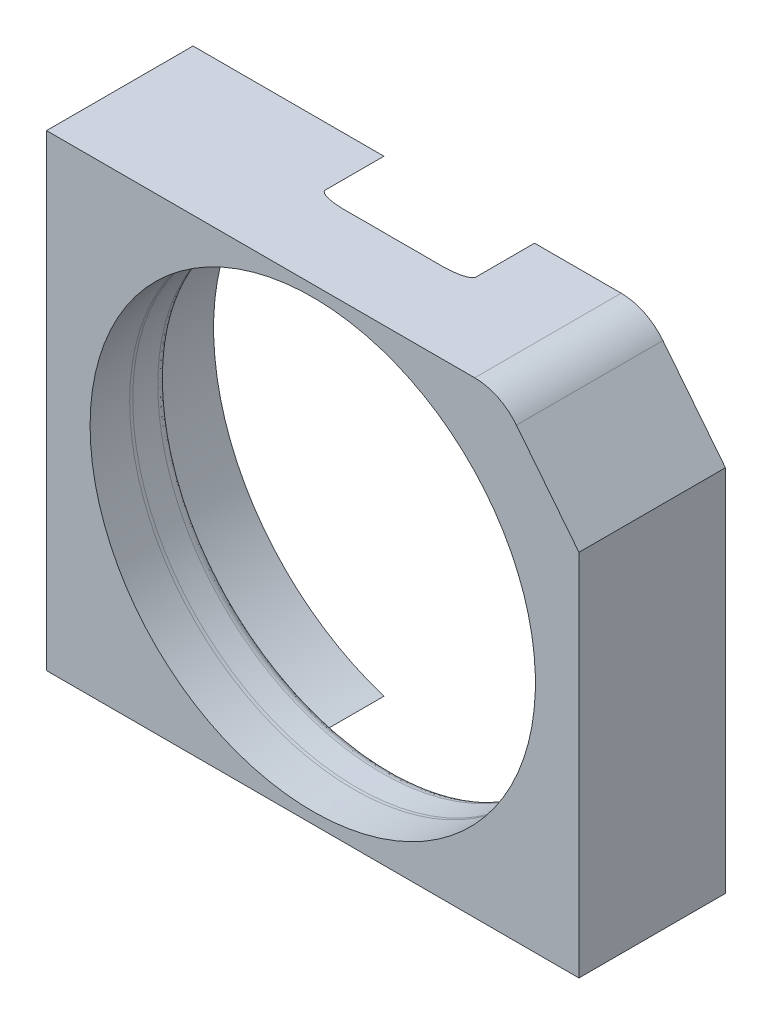
ISO-10303-21;
HEADER;
FILE_DESCRIPTION(('STEP AP214'),'2;1');
FILE_NAME('part.step','',(''),(''),'','','');
FILE_SCHEMA(('AUTOMOTIVE_DESIGN { 1 0 10303 214 1 1 1 1 }'));
ENDSEC;
DATA;
#1=APPLICATION_CONTEXT('core data for automotive mechanical design processes');
#2=APPLICATION_PROTOCOL_DEFINITION('international standard','automotive_design',2000,#1);
#3=PRODUCT_CONTEXT('',#1,'mechanical');
#4=PRODUCT('Part','Part','',(#3));
#5=PRODUCT_RELATED_PRODUCT_CATEGORY('part','',(#4));
#6=PRODUCT_DEFINITION_FORMATION('','',#4);
#7=PRODUCT_DEFINITION_CONTEXT('part definition',#1,'design');
#8=PRODUCT_DEFINITION('design','',#6,#7);
#9=PRODUCT_DEFINITION_SHAPE('','',#8);
#10=(LENGTH_UNIT() NAMED_UNIT(*) SI_UNIT(.MILLI.,.METRE.));
#11=(NAMED_UNIT(*) PLANE_ANGLE_UNIT() SI_UNIT($,.RADIAN.));
#12=(NAMED_UNIT(*) SI_UNIT($,.STERADIAN.) SOLID_ANGLE_UNIT());
#13=UNCERTAINTY_MEASURE_WITH_UNIT(LENGTH_MEASURE(1.E-05),#10,'distance_accuracy_value','');
#14=(GEOMETRIC_REPRESENTATION_CONTEXT(3) GLOBAL_UNCERTAINTY_ASSIGNED_CONTEXT((#13)) GLOBAL_UNIT_ASSIGNED_CONTEXT((#10,
#11,#12)) REPRESENTATION_CONTEXT('',''));
#15=CARTESIAN_POINT('',(0.,0.,0.));
#16=DIRECTION('',(0.,0.,1.));
#17=DIRECTION('',(1.,0.,0.));
#18=AXIS2_PLACEMENT_3D('',#15,#16,#17);
#19=CARTESIAN_POINT('',(241.253264434507,233.525,0.));
#20=DIRECTION('',(0.,0.,-1.));
#21=DIRECTION('',(-1.,0.,0.));
#22=AXIS2_PLACEMENT_3D('',#19,#20,#21);
#23=PLANE('',#22);
#24=CARTESIAN_POINT('',(149.999999999996,131.762500000001,0.));
#25=DIRECTION('',(0.,0.,-1.));
#26=DIRECTION('',(-1.,0.,0.));
#27=AXIS2_PLACEMENT_3D('',#24,#25,#26);
#28=CIRCLE('',#27,138.427487940003);
#29=CARTESIAN_POINT('',(192.435987217568,263.525,0.));
#30=VERTEX_POINT('',#29);
#31=CARTESIAN_POINT('',(192.435987217565,0.,0.));
#32=VERTEX_POINT('',#31);
#33=EDGE_CURVE('E130',#30,#32,#28,.T.);
#34=ORIENTED_EDGE('',*,*,#33,.F.);
#35=DIRECTION('',(-1.,0.,0.));
#36=VECTOR('',#35,1.);
#37=CARTESIAN_POINT('',(71.6,263.525,0.));
#38=LINE('',#37,#36);
#39=CARTESIAN_POINT('',(241.253264434507,263.525,0.));
#40=VERTEX_POINT('',#39);
#41=EDGE_CURVE('E142',#40,#30,#38,.T.);
#42=ORIENTED_EDGE('',*,*,#41,.F.);
#43=CARTESIAN_POINT('',(241.253264434507,233.525,0.));
#44=DIRECTION('',(0.,0.,1.));
#45=DIRECTION('',(-1.,0.,0.));
#46=AXIS2_PLACEMENT_3D('',#43,#44,#45);
#47=CIRCLE('',#46,30.);
#48=CARTESIAN_POINT('',(264.758194807193,252.166841330061,0.));
#49=VERTEX_POINT('',#48);
#50=EDGE_CURVE('E151',#49,#40,#47,.T.);
#51=ORIENTED_EDGE('',*,*,#50,.F.);
#52=DIRECTION('',(-0.621394711002044,0.783497679089534,0.));
#53=VECTOR('',#52,1.);
#54=CARTESIAN_POINT('',(264.758194807193,252.166841330061,0.));
#55=LINE('',#54,#53);
#56=CARTESIAN_POINT('',(300.,207.73152173913,0.));
#57=VERTEX_POINT('',#56);
#58=EDGE_CURVE('E262',#57,#49,#55,.T.);
#59=ORIENTED_EDGE('',*,*,#58,.F.);
#60=DIRECTION('',(0.,1.,0.));
#61=VECTOR('',#60,1.);
#62=CARTESIAN_POINT('',(300.,0.,0.));
#63=LINE('',#62,#61);
#64=CARTESIAN_POINT('',(300.,0.,0.));
#65=VERTEX_POINT('',#64);
#66=EDGE_CURVE('E265',#65,#57,#63,.T.);
#67=ORIENTED_EDGE('',*,*,#66,.F.);
#68=DIRECTION('',(1.,0.,0.));
#69=VECTOR('',#68,1.);
#70=CARTESIAN_POINT('',(0.,0.,0.));
#71=LINE('',#70,#69);
#72=EDGE_CURVE('E145',#32,#65,#71,.T.);
#73=ORIENTED_EDGE('',*,*,#72,.F.);
#74=EDGE_LOOP('',(#34,#42,#51,#59,#67,#73));
#75=FACE_BOUND('',#74,.T.);
#76=ADVANCED_FACE('F35',(#75),#23,.T.);
#77=CARTESIAN_POINT('',(149.999999999999,131.7625,200.400182821007));
#78=DIRECTION('',(0.,0.,1.));
#79=DIRECTION('',(1.,0.,0.));
#80=AXIS2_PLACEMENT_3D('',#77,#78,#79);
#81=CYLINDRICAL_SURFACE('',#80,138.427487940002);
#82=DIRECTION('',(0.,0.,1.));
#83=VECTOR('',#82,1.);
#84=CARTESIAN_POINT('',(192.435987217563,0.,200.400182821006));
#85=LINE('',#84,#83);
#86=CARTESIAN_POINT('',(192.435987217559,0.,33.0000000025175));
#87=VERTEX_POINT('',#86);
#88=EDGE_CURVE('E137',#87,#32,#85,.F.);
#89=ORIENTED_EDGE('',*,*,#88,.F.);
#90=CARTESIAN_POINT('',(149.999999999996,131.762500000001,33.0000000025187));
#91=DIRECTION('',(0.,0.,1.));
#92=DIRECTION('',(1.,0.,0.));
#93=AXIS2_PLACEMENT_3D('',#90,#91,#92);
#94=CIRCLE('',#93,138.427487940002);
#95=CARTESIAN_POINT('',(192.435987217562,263.525000000001,33.0000000025184));
#96=VERTEX_POINT('',#95);
#97=EDGE_CURVE('E133',#87,#96,#94,.T.);
#98=ORIENTED_EDGE('',*,*,#97,.T.);
#99=DIRECTION('',(0.,0.,1.));
#100=VECTOR('',#99,1.);
#101=CARTESIAN_POINT('',(192.435987217565,263.525,200.400182821006));
#102=LINE('',#101,#100);
#103=EDGE_CURVE('E126',#30,#96,#102,.T.);
#104=ORIENTED_EDGE('',*,*,#103,.F.);
#105=ORIENTED_EDGE('',*,*,#33,.T.);
#106=EDGE_LOOP('',(#89,#98,#104,#105));
#107=FACE_BOUND('',#106,.T.);
#108=ADVANCED_FACE('F129',(#107),#81,.F.);
#109=DIRECTION('',(0.,0.,1.));
#110=VECTOR('',#109,1.);
#111=CARTESIAN_POINT('',(107.564012782434,0.,200.400182821008));
#112=LINE('',#111,#110);
#113=CARTESIAN_POINT('',(107.564012782428,0.,0.));
#114=VERTEX_POINT('',#113);
#115=CARTESIAN_POINT('',(107.564012782433,0.,33.000000002519));
#116=VERTEX_POINT('',#115);
#117=EDGE_CURVE('E327',#114,#116,#112,.T.);
#118=ORIENTED_EDGE('',*,*,#117,.F.);
#119=CARTESIAN_POINT('',(107.564012782425,263.525,0.));
#120=VERTEX_POINT('',#119);
#121=EDGE_CURVE('E146',#114,#120,#28,.T.);
#122=ORIENTED_EDGE('',*,*,#121,.T.);
#123=DIRECTION('',(0.,0.,1.));
#124=VECTOR('',#123,1.);
#125=CARTESIAN_POINT('',(107.564012782432,263.525,200.400182821008));
#126=LINE('',#125,#124);
#127=CARTESIAN_POINT('',(107.564012782429,263.525000000001,33.0000000025199));
#128=VERTEX_POINT('',#127);
#129=EDGE_CURVE('E51',#128,#120,#126,.F.);
#130=ORIENTED_EDGE('',*,*,#129,.F.);
#131=EDGE_CURVE('E164',#128,#116,#94,.T.);
#132=ORIENTED_EDGE('',*,*,#131,.T.);
#133=EDGE_LOOP('',(#118,#122,#130,#132));
#134=FACE_BOUND('',#133,.T.);
#135=ADVANCED_FACE('F210',(#134),#81,.F.);
#136=CARTESIAN_POINT('',(283.519735499998,131.762500000001,37.2754741948837));
#137=CARTESIAN_POINT('',(286.705561076155,131.762500000001,37.7272814708559));
#138=CARTESIAN_POINT('',(288.427487939998,131.762500000001,35.3951219955774));
#139=CARTESIAN_POINT('',(288.427487939998,131.762500000001,33.0000000025163));
#140=(BOUNDED_CURVE() B_SPLINE_CURVE(3,(#136,#137,#138,#139),.UNSPECIFIED.,.F.,
.F.) B_SPLINE_CURVE_WITH_KNOTS((4,4),(0.,1.),
.UNSPECIFIED.) CURVE() GEOMETRIC_REPRESENTATION_ITEM() RATIONAL_B_SPLINE_CURVE((0.255591691964592,
0.242825015050017,0.327183181081988,0.508666190060503)) REPRESENTATION_ITEM(''));
#141=CARTESIAN_POINT('',(149.999999999999,131.7625,200.400182821007));
#142=DIRECTION('',(0.,0.,1.));
#143=AXIS1_PLACEMENT('',#141,#142);
#144=SURFACE_OF_REVOLUTION('',#140,#143);
#145=CARTESIAN_POINT('',(107.564012782433,0.,33.000000002519));
#146=CARTESIAN_POINT('',(107.563988911195,0.,33.0434393153711));
#147=CARTESIAN_POINT('',(107.566143823895,0.,33.0868642980806));
#148=CARTESIAN_POINT('',(107.574624732559,0.,33.173242419756));
#149=CARTESIAN_POINT('',(107.580944551883,0.,33.2161961618271));
#150=CARTESIAN_POINT('',(107.597454816036,0.,33.3007307171298));
#151=CARTESIAN_POINT('',(107.607590514751,0.,33.3423223025527));
#152=CARTESIAN_POINT('',(107.631432707945,0.,33.4244716410913));
#153=CARTESIAN_POINT('',(107.645140643406,0.,33.4650289697398));
#154=CARTESIAN_POINT('',(107.698488523508,0.,33.6040140451596));
#155=CARTESIAN_POINT('',(107.746492052493,0.,33.6992960167719));
#156=CARTESIAN_POINT('',(107.857158583655,0.,33.88129015289));
#157=CARTESIAN_POINT('',(107.919906580302,0.,33.9679483186602));
#158=CARTESIAN_POINT('',(108.045715756808,0.,34.1207884449625));
#159=CARTESIAN_POINT('',(108.107411166014,0.,34.1881171948753));
#160=CARTESIAN_POINT('',(108.236385638506,0.,34.3172409887719));
#161=CARTESIAN_POINT('',(108.303669016466,0.,34.3790316786259));
#162=CARTESIAN_POINT('',(108.442492707312,0.,34.4977629716425));
#163=CARTESIAN_POINT('',(108.514038147027,0.,34.5546975247705));
#164=CARTESIAN_POINT('',(108.660323636422,0.,34.6642181857244));
#165=CARTESIAN_POINT('',(108.735062733715,0.,34.7168055763861));
#166=CARTESIAN_POINT('',(108.955482946942,-1.52885071211244E-13,34.8638515831892));
#167=CARTESIAN_POINT('',(109.104453084509,0.,34.9533818094659));
#168=CARTESIAN_POINT('',(109.408534350831,0.,35.121723090095));
#169=CARTESIAN_POINT('',(109.563655579712,0.,35.200515485043));
#170=CARTESIAN_POINT('',(109.878182482482,0.,35.3493041042935));
#171=CARTESIAN_POINT('',(110.037591504249,0.,35.4192931978976));
#172=CARTESIAN_POINT('',(110.360294362463,0.,35.5522455571296));
#173=CARTESIAN_POINT('',(110.523604553766,0.,35.615168751578));
#174=CARTESIAN_POINT('',(110.852332671143,0.,35.7346221830564));
#175=CARTESIAN_POINT('',(111.017748131695,0.,35.7911592477389));
#176=CARTESIAN_POINT('',(111.350268835672,0.,35.89876559062));
#177=CARTESIAN_POINT('',(111.517373428286,0.,35.9498368929839));
#178=CARTESIAN_POINT('',(111.909421724469,0.,36.0636119881737));
#179=CARTESIAN_POINT('',(112.134906907448,0.,36.1244472986272));
#180=CARTESIAN_POINT('',(112.587713832595,0.,36.2389021600031));
#181=CARTESIAN_POINT('',(112.815035804109,0.,36.2925207946015));
#182=CARTESIAN_POINT('',(113.271362522591,0.,36.3935729941314));
#183=CARTESIAN_POINT('',(113.500369112764,0.,36.4409981956174));
#184=CARTESIAN_POINT('',(113.95945745267,0.,36.5303478237248));
#185=CARTESIAN_POINT('',(114.189539261048,0.,36.572271946598));
#186=CARTESIAN_POINT('',(114.881710117119,0.,36.6908713714809));
#187=CARTESIAN_POINT('',(115.345058939133,0.,36.7602305510334));
#188=CARTESIAN_POINT('',(116.273882629915,0.,36.8832723715307));
#189=CARTESIAN_POINT('',(116.739357962509,0.,36.9369514085703));
#190=CARTESIAN_POINT('',(117.672366678869,0.,37.0313983651965));
#191=CARTESIAN_POINT('',(118.139902180108,0.,37.0721451074191));
#192=CARTESIAN_POINT('',(119.07522300323,0.,37.1426513582287));
#193=CARTESIAN_POINT('',(119.543007359201,0.,37.172423936171));
#194=CARTESIAN_POINT('',(120.478822552575,0.,37.2226797348076));
#195=CARTESIAN_POINT('',(120.946853137393,0.,37.2431677516684));
#196=CARTESIAN_POINT('',(121.883171291607,0.,37.2762229129907));
#197=CARTESIAN_POINT('',(122.351458851319,1.00978485318525E-13,37.288790337833));
#198=CARTESIAN_POINT('',(123.131279353968,0.,37.3040646799129));
#199=CARTESIAN_POINT('',(123.442777675769,0.,37.3086644314646));
#200=CARTESIAN_POINT('',(124.065855234345,0.,37.3151557165911));
#201=CARTESIAN_POINT('',(124.377434475892,0.,37.3170467915974));
#202=CARTESIAN_POINT('',(125.000627699693,0.,37.3183916086862));
#203=CARTESIAN_POINT('',(125.312241682374,0.,37.3178451131127));
#204=CARTESIAN_POINT('',(125.933408276533,0.,37.3145762343991));
#205=CARTESIAN_POINT('',(126.242960966596,0.,37.3118681852725));
#206=CARTESIAN_POINT('',(126.862011405921,0.,37.3045255586764));
#207=CARTESIAN_POINT('',(127.171509157569,0.,37.2998911770293));
#208=CARTESIAN_POINT('',(127.790405207438,0.,37.2889117740155));
#209=CARTESIAN_POINT('',(128.099803512413,0.,37.2825671358307));
#210=CARTESIAN_POINT('',(128.409183393385,0.,37.2754741948859));
#211=B_SPLINE_CURVE_WITH_KNOTS('',3,(#145,#146,#147,#148,#149,#150,#151,#152,#153,#154,#155,
#156,#157,#158,#159,#160,#161,#162,#163,#164,#165,#166,#167,#168,#169,#170,#171,#172,#173,#174,
#175,#176,#177,#178,#179,#180,#181,#182,#183,#184,#185,#186,#187,#188,#189,#190,#191,#192,#193,
#194,#195,#196,#197,#198,#199,#200,#201,#202,#203,#204,#205,#206,#207,#208,#209,#210),
.UNSPECIFIED.,.F.,.F.,(4,2,2,2,2,2,2,2,2,2,2,2,2,2,2,2,2,2,2,2,2,2,2,2,2,2,2,2,2,2,2,2,4),(0.,
0.130241429364125,0.260290141443634,0.388540068376498,0.516841809550053,0.834941817756587,
1.15492255672217,1.42848738000261,1.70226543229411,1.97637973595558,2.25041285831291,
2.77116249269915,3.29280581231076,3.81486898006019,4.33975738168677,4.86407918468302,
5.38820613589148,6.08869943050479,6.7892815852258,7.4908002146516,8.19235756293695,
9.59751309808097,11.002991338828,12.4107593945459,13.816845452039,15.2222043311808,
16.6275134592734,17.5620991178273,18.4968429794866,19.4316779779737,20.3603647546451,
21.288957148295,22.2173416641329),.UNSPECIFIED.);
#212=CARTESIAN_POINT('',(128.409183393386,0.,37.275474194886));
#213=VERTEX_POINT('',#212);
#214=EDGE_CURVE('E59',#116,#213,#211,.T.);
#215=ORIENTED_EDGE('',*,*,#214,.F.);
#216=ORIENTED_EDGE('',*,*,#131,.F.);
#217=CARTESIAN_POINT('',(128.409183393374,263.525,37.2754741948868));
#218=CARTESIAN_POINT('',(128.051894710239,263.525,37.2836641761605));
#219=CARTESIAN_POINT('',(127.6945808691,263.525,37.2908580436216));
#220=CARTESIAN_POINT('',(126.979800252876,263.525,37.3029213767301));
#221=CARTESIAN_POINT('',(126.622333465375,263.525,37.3077900998672));
#222=CARTESIAN_POINT('',(125.907308636066,263.525,37.3148659469851));
#223=CARTESIAN_POINT('',(125.549750589352,263.525,37.3170725961095));
#224=CARTESIAN_POINT('',(124.834606252839,263.525,37.3184574758383));
#225=CARTESIAN_POINT('',(124.477019962629,263.525,37.3176355252875));
#226=CARTESIAN_POINT('',(123.760859504184,263.525,37.3125603889058));
#227=CARTESIAN_POINT('',(123.402285400806,263.525,37.3082975102587));
#228=CARTESIAN_POINT('',(122.685229894357,263.525,37.2958901570463));
#229=CARTESIAN_POINT('',(122.326748486316,263.525,37.2877459769455));
#230=CARTESIAN_POINT('',(121.60994018102,263.525,37.2670886446054));
#231=CARTESIAN_POINT('',(121.251613273173,263.525,37.2545758660324));
#232=CARTESIAN_POINT('',(120.53517713601,263.525,37.2246302296394));
#233=CARTESIAN_POINT('',(120.177067898286,263.525,37.2071975758378));
#234=CARTESIAN_POINT('',(119.472458511016,263.525,37.1674163274857));
#235=CARTESIAN_POINT('',(119.125948714547,263.525,37.1452402692858));
#236=CARTESIAN_POINT('',(118.433337233113,263.525,37.0950078689188));
#237=CARTESIAN_POINT('',(118.087235565238,263.525,37.0669512887018));
#238=CARTESIAN_POINT('',(117.39558596318,263.525,37.0041603520604));
#239=CARTESIAN_POINT('',(117.050038109821,263.525,36.9694250971018));
#240=CARTESIAN_POINT('',(116.359590004402,263.525,36.8922968555982));
#241=CARTESIAN_POINT('',(116.014690234281,263.525,36.8498995114988));
#242=CARTESIAN_POINT('',(115.326116320868,263.525,36.7562713772811));
#243=CARTESIAN_POINT('',(114.982442058973,263.525,36.7050414670269));
#244=CARTESIAN_POINT('',(114.296852999469,263.525,36.5922400283021));
#245=CARTESIAN_POINT('',(113.954937812492,263.525,36.5306708997104));
#246=CARTESIAN_POINT('',(113.342578387325,263.525,36.4088892849372));
#247=CARTESIAN_POINT('',(113.071688159953,263.525,36.350928985456));
#248=CARTESIAN_POINT('',(112.531986217608,263.525,36.2257654929522));
#249=CARTESIAN_POINT('',(112.263174825383,263.525,36.1585608939787));
#250=CARTESIAN_POINT('',(111.729479500192,263.525,36.0133604224585));
#251=CARTESIAN_POINT('',(111.464584999961,263.525,35.9354037755901));
#252=CARTESIAN_POINT('',(110.939177098807,263.525,35.7660655485733));
#253=CARTESIAN_POINT('',(110.678661894095,263.525,35.6746896545641));
#254=CARTESIAN_POINT('',(110.223056142982,263.525,35.4977009565297));
#255=CARTESIAN_POINT('',(110.026636970608,263.525,35.4155548510646));
#256=CARTESIAN_POINT('',(109.735818493693,263.525,35.2826000075541));
#257=CARTESIAN_POINT('',(109.639255498186,263.525,35.2365197732933));
#258=CARTESIAN_POINT('',(109.447949554132,263.525,35.1407358617284));
#259=CARTESIAN_POINT('',(109.35320641394,263.525,35.091032568634));
#260=CARTESIAN_POINT('',(109.138333573493,263.525,34.9722147119986));
#261=CARTESIAN_POINT('',(109.018968390922,263.525,34.9017020260968));
#262=CARTESIAN_POINT('',(108.785349757699,263.525,34.7522949595584));
#263=CARTESIAN_POINT('',(108.671101925771,263.525,34.6733916720582));
#264=CARTESIAN_POINT('',(108.450989762533,263.525,34.506097782546));
#265=CARTESIAN_POINT('',(108.345070978818,263.525,34.4177796013186));
#266=CARTESIAN_POINT('',(108.144622993734,263.525,34.2291331654217));
#267=CARTESIAN_POINT('',(108.050062419983,263.525,34.1288395928631));
#268=CARTESIAN_POINT('',(107.935041881477,263.525,33.9848109789745));
#269=CARTESIAN_POINT('',(107.906759946686,263.525,33.9472762981489));
#270=CARTESIAN_POINT('',(107.852620597751,263.525,33.8704851403311));
#271=CARTESIAN_POINT('',(107.826763127543,263.525,33.8312287031852));
#272=CARTESIAN_POINT('',(107.777981826993,263.525,33.7511543108066));
#273=CARTESIAN_POINT('',(107.755045988739,263.525,33.7103437059798));
#274=CARTESIAN_POINT('',(107.712426164581,263.525,33.6270452176555));
#275=CARTESIAN_POINT('',(107.692742285601,263.525,33.584557279064));
#276=CARTESIAN_POINT('',(107.657416466249,263.525,33.4987945123038));
#277=CARTESIAN_POINT('',(107.641709629132,263.525,33.4555465963542));
#278=CARTESIAN_POINT('',(107.61433987614,263.525,33.367798178957));
#279=CARTESIAN_POINT('',(107.602675383712,263.525,33.3232981731746));
#280=CARTESIAN_POINT('',(107.583625199713,263.525,33.2326422484606));
#281=CARTESIAN_POINT('',(107.576310440143,263.525,33.1864712531426));
#282=CARTESIAN_POINT('',(107.566483790554,263.525,33.093540588437));
#283=CARTESIAN_POINT('',(107.563980524835,263.525,33.0467800129328));
#284=CARTESIAN_POINT('',(107.564012782427,263.525,33.0000000025199));
#285=B_SPLINE_CURVE_WITH_KNOTS('',3,(#217,#218,#219,#220,#221,#222,#223,#224,#225,#226,#227,
#228,#229,#230,#231,#232,#233,#234,#235,#236,#237,#238,#239,#240,#241,#242,#243,#244,#245,#246,
#247,#248,#249,#250,#251,#252,#253,#254,#255,#256,#257,#258,#259,#260,#261,#262,#263,#264,#265,
#266,#267,#268,#269,#270,#271,#272,#273,#274,#275,#276,#277,#278,#279,#280,#281,#282,#283,#284),
.UNSPECIFIED.,.F.,.F.,(4,2,2,2,2,2,2,2,2,2,2,2,2,2,2,2,2,2,2,2,2,2,2,2,2,2,2,2,2,2,2,2,2,4),(0.,
1.07214969800926,2.14464154708534,3.21732467720169,4.29007197070426,5.36585169632604,
6.44154981826362,7.51715595332175,8.59271749148728,9.63432970381734,10.6759840898922,
11.7177787160515,12.7601677029906,13.802452911334,14.8444965240809,15.6754296450747,
16.5064892813857,17.3345935148826,18.1623478627303,18.8006703086957,19.1215899108674,
19.4424755302602,19.8581120492394,20.2741942678702,20.6872798417487,21.0991968367766,
21.2401141352356,21.3810281741905,21.5213429653124,21.6616623690712,21.799518187145,
21.9373201794314,22.0773117464936,22.2175540064837),.UNSPECIFIED.);
#286=CARTESIAN_POINT('',(128.409183393374,263.525,37.2754741948869));
#287=VERTEX_POINT('',#286);
#288=EDGE_CURVE('E199',#287,#128,#285,.T.);
#289=ORIENTED_EDGE('',*,*,#288,.F.);
#290=CARTESIAN_POINT('',(149.999999999996,131.762500000001,37.2754741948861));
#291=DIRECTION('',(0.,0.,1.));
#292=DIRECTION('',(1.,0.,0.));
#293=AXIS2_PLACEMENT_3D('',#290,#291,#292);
#294=CIRCLE('',#293,133.519735500002);
#295=EDGE_CURVE('E331',#287,#213,#294,.T.);
#296=ORIENTED_EDGE('',*,*,#295,.T.);
#297=EDGE_LOOP('',(#215,#216,#289,#296));
#298=FACE_BOUND('',#297,.T.);
#299=ADVANCED_FACE('F205',(#298),#144,.T.);
#300=CARTESIAN_POINT('',(171.590816606606,0.,37.2754741948852));
#301=CARTESIAN_POINT('',(171.948105289742,0.,37.2836641761588));
#302=CARTESIAN_POINT('',(172.305419130881,0.,37.2908580436199));
#303=CARTESIAN_POINT('',(173.020199747104,0.,37.3029213767283));
#304=CARTESIAN_POINT('',(173.377666534605,0.,37.3077900998654));
#305=CARTESIAN_POINT('',(174.092691363915,0.,37.3148659469833));
#306=CARTESIAN_POINT('',(174.450249410628,0.,37.3170725961077));
#307=CARTESIAN_POINT('',(175.165393747142,0.,37.3184574758365));
#308=CARTESIAN_POINT('',(175.522980037352,0.,37.3176355252857));
#309=CARTESIAN_POINT('',(176.239140495796,0.,37.3125603889039));
#310=CARTESIAN_POINT('',(176.597714599174,0.,37.3082975102568));
#311=CARTESIAN_POINT('',(177.314770105624,0.,37.2958901570445));
#312=CARTESIAN_POINT('',(177.673251513664,0.,37.2877459769437));
#313=CARTESIAN_POINT('',(178.39005981896,0.,37.2670886446036));
#314=CARTESIAN_POINT('',(178.748386726808,0.,37.2545758660306));
#315=CARTESIAN_POINT('',(179.46482286397,0.,37.2246302296376));
#316=CARTESIAN_POINT('',(179.822932101695,0.,37.207197575836));
#317=CARTESIAN_POINT('',(180.527541488965,0.,37.1674163274839));
#318=CARTESIAN_POINT('',(180.874051285433,0.,37.145240269284));
#319=CARTESIAN_POINT('',(181.566662766868,0.,37.095007868917));
#320=CARTESIAN_POINT('',(181.912764434743,0.,37.0669512887));
#321=CARTESIAN_POINT('',(182.604414036801,0.,37.0041603520587));
#322=CARTESIAN_POINT('',(182.94996189016,0.,36.9694250971001));
#323=CARTESIAN_POINT('',(183.64040999558,0.,36.8922968555965));
#324=CARTESIAN_POINT('',(183.985309765701,0.,36.849899511497));
#325=CARTESIAN_POINT('',(184.673883679114,0.,36.7562713772792));
#326=CARTESIAN_POINT('',(185.017557941009,0.,36.7050414670251));
#327=CARTESIAN_POINT('',(185.703147000513,0.,36.5922400283003));
#328=CARTESIAN_POINT('',(186.04506218749,0.,36.5306708997086));
#329=CARTESIAN_POINT('',(186.657421612658,0.,36.4088892849355));
#330=CARTESIAN_POINT('',(186.92831184003,0.,36.3509289854544));
#331=CARTESIAN_POINT('',(187.468013782375,0.,36.2257654929505));
#332=CARTESIAN_POINT('',(187.7368251746,0.,36.1585608939769));
#333=CARTESIAN_POINT('',(188.270520499792,0.,36.0133604224565));
#334=CARTESIAN_POINT('',(188.535415000023,0.,35.9354037755883));
#335=CARTESIAN_POINT('',(189.060822901178,0.,35.7660655485716));
#336=CARTESIAN_POINT('',(189.32133810589,0.,35.6746896545623));
#337=CARTESIAN_POINT('',(189.776943857002,0.,35.4977009565278));
#338=CARTESIAN_POINT('',(189.973363029377,0.,35.4155548510626));
#339=CARTESIAN_POINT('',(190.264181506291,0.,35.2826000075521));
#340=CARTESIAN_POINT('',(190.360744501799,0.,35.2365197732914));
#341=CARTESIAN_POINT('',(190.552050445853,0.,35.1407358617264));
#342=CARTESIAN_POINT('',(190.646793586045,0.,35.0910325686321));
#343=CARTESIAN_POINT('',(190.861666426492,0.,34.9722147119966));
#344=CARTESIAN_POINT('',(190.981031609064,0.,34.9017020260949));
#345=CARTESIAN_POINT('',(191.214650242286,0.,34.7522949595564));
#346=CARTESIAN_POINT('',(191.328898074214,0.,34.6733916720561));
#347=CARTESIAN_POINT('',(191.549010237452,0.,34.5060977825438));
#348=CARTESIAN_POINT('',(191.654929021168,0.,34.4177796013163));
#349=CARTESIAN_POINT('',(191.855377006251,0.,34.2291331654195));
#350=CARTESIAN_POINT('',(191.949937580003,0.,34.1288395928609));
#351=CARTESIAN_POINT('',(192.064958118508,0.,33.9848109789724));
#352=CARTESIAN_POINT('',(192.0932400533,0.,33.9472762981468));
#353=CARTESIAN_POINT('',(192.147379402234,0.,33.870485140329));
#354=CARTESIAN_POINT('',(192.173236872443,0.,33.8312287031831));
#355=CARTESIAN_POINT('',(192.222018172993,0.,33.7511543108045));
#356=CARTESIAN_POINT('',(192.244954011247,0.,33.7103437059777));
#357=CARTESIAN_POINT('',(192.287573835405,0.,33.6270452176534));
#358=CARTESIAN_POINT('',(192.307257714384,0.,33.5845572790619));
#359=CARTESIAN_POINT('',(192.342583533736,0.,33.4987945123017));
#360=CARTESIAN_POINT('',(192.358290370854,0.,33.455546596352));
#361=CARTESIAN_POINT('',(192.385660123846,0.,33.3677981789548));
#362=CARTESIAN_POINT('',(192.397324616273,0.,33.3232981731723));
#363=CARTESIAN_POINT('',(192.416374800273,0.,33.2326422484583));
#364=CARTESIAN_POINT('',(192.423689559843,0.,33.1864712531402));
#365=CARTESIAN_POINT('',(192.433516209432,0.,33.0935405884347));
#366=CARTESIAN_POINT('',(192.436019475151,0.,33.0467800129304));
#367=CARTESIAN_POINT('',(192.435987217559,1.66533453693773E-13,33.0000000025175));
#368=B_SPLINE_CURVE_WITH_KNOTS('',3,(#300,#301,#302,#303,#304,#305,#306,#307,#308,#309,#310,
#311,#312,#313,#314,#315,#316,#317,#318,#319,#320,#321,#322,#323,#324,#325,#326,#327,#328,#329,
#330,#331,#332,#333,#334,#335,#336,#337,#338,#339,#340,#341,#342,#343,#344,#345,#346,#347,#348,
#349,#350,#351,#352,#353,#354,#355,#356,#357,#358,#359,#360,#361,#362,#363,#364,#365,#366,#367),
.UNSPECIFIED.,.F.,.F.,(4,2,2,2,2,2,2,2,2,2,2,2,2,2,2,2,2,2,2,2,2,2,2,2,2,2,2,2,2,2,2,2,2,4),(0.,
1.07214969800926,2.14464154708536,3.21732467720168,4.29007197070429,5.36585169632604,
6.44154981826365,7.51715595332172,8.59271749148726,9.63432970381774,10.675984089893,
11.7177787160528,12.7601677029922,13.8024529113361,14.8444965240834,15.6754296450776,
16.506489281389,17.3345935148862,18.1623478627342,18.8006703086998,19.1215899108716,
19.4424755302646,19.858112049244,20.274194267875,20.6872798417536,21.0991968367816,
21.2401141352407,21.3810281741955,21.5213429653174,21.6616623690763,21.7995181871501,
21.9373201794366,22.077311746499,22.2175540064891),.UNSPECIFIED.);
#369=CARTESIAN_POINT('',(171.590816606605,0.,37.2754741948853));
#370=VERTEX_POINT('',#369);
#371=EDGE_CURVE('E307',#370,#87,#368,.T.);
#372=ORIENTED_EDGE('',*,*,#371,.F.);
#373=CARTESIAN_POINT('',(171.590816606617,263.525,37.2754741948862));
#374=VERTEX_POINT('',#373);
#375=EDGE_CURVE('E154',#370,#374,#294,.T.);
#376=ORIENTED_EDGE('',*,*,#375,.T.);
#377=CARTESIAN_POINT('',(192.435987217564,263.525,33.0000000025184));
#378=CARTESIAN_POINT('',(192.436011088802,263.525,33.0434393153706));
#379=CARTESIAN_POINT('',(192.433856176102,263.525,33.08686429808));
#380=CARTESIAN_POINT('',(192.425375267438,263.525,33.1732424197555));
#381=CARTESIAN_POINT('',(192.419055448113,263.525,33.2161961618266));
#382=CARTESIAN_POINT('',(192.402545183961,263.525,33.3007307171293));
#383=CARTESIAN_POINT('',(192.392409485246,263.525,33.3423223025522));
#384=CARTESIAN_POINT('',(192.368567292052,263.525,33.4244716410908));
#385=CARTESIAN_POINT('',(192.354859356591,263.525,33.4650289697393));
#386=CARTESIAN_POINT('',(192.301511476489,263.525,33.6040140451591));
#387=CARTESIAN_POINT('',(192.253507947504,263.525,33.6992960167715));
#388=CARTESIAN_POINT('',(192.142841416342,263.525,33.8812901528896));
#389=CARTESIAN_POINT('',(192.080093419695,263.525,33.9679483186598));
#390=CARTESIAN_POINT('',(191.954284243189,263.525,34.1207884449622));
#391=CARTESIAN_POINT('',(191.892588833982,263.525,34.1881171948751));
#392=CARTESIAN_POINT('',(191.76361436149,263.525,34.3172409887717));
#393=CARTESIAN_POINT('',(191.69633098353,263.525,34.3790316786258));
#394=CARTESIAN_POINT('',(191.557507292685,263.525,34.4977629716423));
#395=CARTESIAN_POINT('',(191.485961852969,263.525,34.5546975247703));
#396=CARTESIAN_POINT('',(191.339676363574,263.525,34.6642181857243));
#397=CARTESIAN_POINT('',(191.264937266281,263.525,34.7168055763861));
#398=CARTESIAN_POINT('',(191.044517053055,263.525,34.8638515831894));
#399=CARTESIAN_POINT('',(190.895546915487,263.525,34.953381809466));
#400=CARTESIAN_POINT('',(190.591465649165,263.525,35.121723090095));
#401=CARTESIAN_POINT('',(190.436344420284,263.525,35.200515485043));
#402=CARTESIAN_POINT('',(190.121817517514,263.525,35.3493041042936));
#403=CARTESIAN_POINT('',(189.962408495746,263.525,35.4192931978977));
#404=CARTESIAN_POINT('',(189.639705637532,263.525,35.5522455571298));
#405=CARTESIAN_POINT('',(189.476395446229,263.525,35.6151687515782));
#406=CARTESIAN_POINT('',(189.147667328852,263.525,35.7346221830566));
#407=CARTESIAN_POINT('',(188.9822518683,263.525,35.7911592477392));
#408=CARTESIAN_POINT('',(188.649731164323,263.525,35.8987655906204));
#409=CARTESIAN_POINT('',(188.482626571709,263.525,35.9498368929843));
#410=CARTESIAN_POINT('',(188.090578275526,263.525,36.0636119881741));
#411=CARTESIAN_POINT('',(187.865093092547,263.525,36.1244472986276));
#412=CARTESIAN_POINT('',(187.412286167399,263.525,36.2389021600035));
#413=CARTESIAN_POINT('',(187.184964195884,263.525,36.2925207946019));
#414=CARTESIAN_POINT('',(186.728637477402,263.525,36.3935729941319));
#415=CARTESIAN_POINT('',(186.49963088723,263.525,36.4409981956179));
#416=CARTESIAN_POINT('',(186.040542547323,263.525,36.5303478237254));
#417=CARTESIAN_POINT('',(185.810460738945,263.525,36.5722719465985));
#418=CARTESIAN_POINT('',(185.118289882874,263.525,36.6908713714814));
#419=CARTESIAN_POINT('',(184.654941060859,263.525,36.760230551034));
#420=CARTESIAN_POINT('',(183.726117370076,263.525,36.8832723715313));
#421=CARTESIAN_POINT('',(183.260642037482,263.525,36.9369514085709));
#422=CARTESIAN_POINT('',(182.327633321121,263.525,37.031398365197));
#423=CARTESIAN_POINT('',(181.860097819882,263.525,37.0721451074196));
#424=CARTESIAN_POINT('',(180.92477699676,263.525,37.1426513582292));
#425=CARTESIAN_POINT('',(180.456992640789,263.525,37.1724239361714));
#426=CARTESIAN_POINT('',(179.521177447414,263.525,37.222679734808));
#427=CARTESIAN_POINT('',(179.053146862595,263.525,37.2431677516688));
#428=CARTESIAN_POINT('',(178.11682870838,263.525,37.276222912991));
#429=CARTESIAN_POINT('',(177.648541148668,263.525,37.2887903378332));
#430=CARTESIAN_POINT('',(176.868720646019,263.525,37.3040646799131));
#431=CARTESIAN_POINT('',(176.55722232422,263.525,37.3086644314647));
#432=CARTESIAN_POINT('',(175.934144765646,263.525,37.3151557165912));
#433=CARTESIAN_POINT('',(175.6225655241,263.525,37.3170467915974));
#434=CARTESIAN_POINT('',(174.9993723003,263.525,37.3183916086863));
#435=CARTESIAN_POINT('',(174.68775831762,263.525,37.3178451131127));
#436=CARTESIAN_POINT('',(174.066591723463,263.525,37.3145762343992));
#437=CARTESIAN_POINT('',(173.7570390334,263.525,37.3118681852725));
#438=CARTESIAN_POINT('',(173.137988594077,263.525,37.3045255586765));
#439=CARTESIAN_POINT('',(172.82849084243,263.525,37.2998911770294));
#440=CARTESIAN_POINT('',(172.209594792562,263.525,37.2889117740157));
#441=CARTESIAN_POINT('',(171.900196487588,263.525,37.2825671358309));
#442=CARTESIAN_POINT('',(171.590816606617,263.525,37.2754741948861));
#443=B_SPLINE_CURVE_WITH_KNOTS('',3,(#377,#378,#379,#380,#381,#382,#383,#384,#385,#386,#387,
#388,#389,#390,#391,#392,#393,#394,#395,#396,#397,#398,#399,#400,#401,#402,#403,#404,#405,#406,
#407,#408,#409,#410,#411,#412,#413,#414,#415,#416,#417,#418,#419,#420,#421,#422,#423,#424,#425,
#426,#427,#428,#429,#430,#431,#432,#433,#434,#435,#436,#437,#438,#439,#440,#441,#442),
.UNSPECIFIED.,.F.,.F.,(4,2,2,2,2,2,2,2,2,2,2,2,2,2,2,2,2,2,2,2,2,2,2,2,2,2,2,2,2,2,2,2,4),(0.,
0.130241429364157,0.260290141443698,0.388540068376575,0.516841809550153,0.834941817756816,
1.15492255672254,1.42848738000307,1.70226543229465,1.97637973595619,2.25041285831362,
2.77116249270016,3.29280581231198,3.81486898006165,4.33975738168852,4.86407918468506,
5.38820613589385,6.08869943050761,6.78928158522914,7.4908002146554,8.19235756294127,
9.5975130980863,11.0029913388343,12.4107593945532,13.8168454520471,15.2222043311899,
16.6275134592834,17.5620991178346,18.4968429794914,19.431677977976,20.3603647546448,
21.2889571482922,22.2173416641275),.UNSPECIFIED.);
#444=EDGE_CURVE('E179',#96,#374,#443,.T.);
#445=ORIENTED_EDGE('',*,*,#444,.F.);
#446=ORIENTED_EDGE('',*,*,#97,.F.);
#447=EDGE_LOOP('',(#372,#376,#445,#446));
#448=FACE_BOUND('',#447,.T.);
#449=ADVANCED_FACE('F209',(#448),#144,.T.);
#450=CARTESIAN_POINT('',(283.519735499998,131.762500000001,37.2754741948838));
#451=CARTESIAN_POINT('',(278.834697888002,131.762500000001,36.6110517302186));
#452=CARTESIAN_POINT('',(276.302452499998,131.762500000001,40.0406980173928));
#453=CARTESIAN_POINT('',(276.302452499998,131.762500000001,43.5629362424831));
#454=(BOUNDED_CURVE() B_SPLINE_CURVE(3,(#450,#451,#452,#453),.UNSPECIFIED.,.F.,
.F.) B_SPLINE_CURVE_WITH_KNOTS((4,4),(0.,1.),
.UNSPECIFIED.) CURVE() GEOMETRIC_REPRESENTATION_ITEM() RATIONAL_B_SPLINE_CURVE((0.255591691964593,
0.242825015050018,0.327183181081988,0.508666190060503)) REPRESENTATION_ITEM(''));
#455=CARTESIAN_POINT('',(149.999999999999,131.7625,200.400182821007));
#456=DIRECTION('',(0.,0.,1.));
#457=AXIS1_PLACEMENT('',#455,#456);
#458=SURFACE_OF_REVOLUTION('',#454,#457);
#459=CARTESIAN_POINT('',(149.999999999996,131.762500000001,43.5629362424853));
#460=DIRECTION('',(0.,0.,1.));
#461=DIRECTION('',(1.,0.,0.));
#462=AXIS2_PLACEMENT_3D('',#459,#460,#461);
#463=CIRCLE('',#462,126.302452500002);
#464=CARTESIAN_POINT('',(276.302452499998,131.762500000001,43.5629362424831));
#465=VERTEX_POINT('',#464);
#466=EDGE_CURVE('E167',#465,#465,#463,.T.);
#467=ORIENTED_EDGE('',*,*,#466,.T.);
#468=EDGE_LOOP('',(#467));
#469=FACE_BOUND('',#468,.T.);
#470=ORIENTED_EDGE('',*,*,#375,.F.);
#471=CARTESIAN_POINT('',(171.590816606605,0.,37.2754741948853));
#472=CARTESIAN_POINT('',(171.064684655764,0.,37.2634224363267));
#473=CARTESIAN_POINT('',(170.538508494476,0.,37.253543503334));
#474=CARTESIAN_POINT('',(169.48614716092,0.,37.2374264662814));
#475=CARTESIAN_POINT('',(168.959961993763,0.,37.2311880332917));
#476=CARTESIAN_POINT('',(167.907587397973,0.,37.221645436284));
#477=CARTESIAN_POINT('',(167.381397970301,0.,37.2183411582891));
#478=CARTESIAN_POINT('',(166.329014771242,0.,37.2140483026068));
#479=CARTESIAN_POINT('',(165.802820999931,0.,37.2130597054435));
#480=CARTESIAN_POINT('',(164.750427884481,0.,37.2128345851055));
#481=CARTESIAN_POINT('',(164.224228540346,0.,37.2135980813782));
#482=CARTESIAN_POINT('',(163.171826466514,0.,37.2163711429064));
#483=CARTESIAN_POINT('',(162.645623736865,0.,37.2183807248149));
#484=CARTESIAN_POINT('',(161.593216610895,0.,37.2231925593121));
#485=CARTESIAN_POINT('',(161.067012214613,0.,37.2259948201949));
#486=CARTESIAN_POINT('',(160.01460375471,0.,37.2319931499312));
#487=CARTESIAN_POINT('',(159.488399691097,-1.16490100750044E-13,37.2351892202871));
#488=CARTESIAN_POINT('',(158.113508956114,-1.74724667123726E-13,37.2435928187345));
#489=CARTESIAN_POINT('',(157.264822474934,0.,37.2488326767224));
#490=CARTESIAN_POINT('',(155.567443446167,0.,37.258242502236));
#491=CARTESIAN_POINT('',(154.718750898581,0.,37.2624124701053));
#492=CARTESIAN_POINT('',(153.021367368389,0.,37.2688930427396));
#493=CARTESIAN_POINT('',(152.172676385865,0.,37.2712036674691));
#494=CARTESIAN_POINT('',(150.475291001677,0.,37.2735609607814));
#495=CARTESIAN_POINT('',(149.626596600013,0.,37.2736076291279));
#496=CARTESIAN_POINT('',(147.929202689568,0.,37.2714292544039));
#497=CARTESIAN_POINT('',(147.080503180816,0.,37.2692041893911));
#498=CARTESIAN_POINT('',(145.383112234237,0.,37.2628704112612));
#499=CARTESIAN_POINT('',(144.534420796404,0.,37.2587616995004));
#500=CARTESIAN_POINT('',(142.837026779271,0.,37.2494376641427));
#501=CARTESIAN_POINT('',(141.988324200108,0.,37.2442223174883));
#502=CARTESIAN_POINT('',(140.29091876151,0.,37.233834323784));
#503=CARTESIAN_POINT('',(139.442215902076,0.,37.2286616767284));
#504=CARTESIAN_POINT('',(138.027709437139,0.,37.2213439100921));
#505=CARTESIAN_POINT('',(137.461908235724,0.,37.2187643559825));
#506=CARTESIAN_POINT('',(136.330303769351,0.,37.2148419638547));
#507=CARTESIAN_POINT('',(135.764500504415,0.,37.2134991201334));
#508=CARTESIAN_POINT('',(134.632898741626,0.,37.2126551063438));
#509=CARTESIAN_POINT('',(134.067100243799,0.,37.2131539137984));
#510=CARTESIAN_POINT('',(132.93548338938,0.,37.2166755781875));
#511=CARTESIAN_POINT('',(132.369665033123,0.,37.2196985551037));
#512=CARTESIAN_POINT('',(131.238045848743,0.,37.2290223167447));
#513=CARTESIAN_POINT('',(130.672245020926,0.,37.2353231422157));
#514=CARTESIAN_POINT('',(129.540673873198,0.,37.2520713840697));
#515=CARTESIAN_POINT('',(128.974903556808,0.,37.2625190343744));
#516=CARTESIAN_POINT('',(128.409183393386,0.,37.275474194886));
#517=B_SPLINE_CURVE_WITH_KNOTS('',3,(#471,#472,#473,#474,#475,#476,#477,#478,#479,#480,#481,
#482,#483,#484,#485,#486,#487,#488,#489,#490,#491,#492,#493,#494,#495,#496,#497,#498,#499,#500,
#501,#502,#503,#504,#505,#506,#507,#508,#509,#510,#511,#512,#513,#514,#515,#516),.UNSPECIFIED.,
.F.,.F.,(4,2,2,2,2,2,2,2,2,2,2,2,2,2,2,2,2,2,2,2,2,2,4),(0.,1.57879740934248,3.1574521475984,
4.73604556052074,6.31462569662369,7.89322335427827,9.47184210937682,11.0504773829364,
12.6291186801293,15.1752265693753,17.7213336406714,20.2674133730689,22.8134933712762,
25.3595979617807,27.9057007187734,30.4518565303713,32.998012006408,34.695432451398,
36.3928450686722,38.0902369692487,39.7877095567078,41.4852032455849,43.1827927033874),.UNSPECIFIED.);
#518=EDGE_CURVE('E306',#370,#213,#517,.T.);
#519=ORIENTED_EDGE('',*,*,#518,.T.);
#520=ORIENTED_EDGE('',*,*,#295,.F.);
#521=CARTESIAN_POINT('',(128.409183393375,263.525,37.2754741948869));
#522=CARTESIAN_POINT('',(128.935315344216,263.525,37.2634224363284));
#523=CARTESIAN_POINT('',(129.461491505504,263.525,37.2535435033356));
#524=CARTESIAN_POINT('',(130.513852839061,263.525,37.237426466283));
#525=CARTESIAN_POINT('',(131.040038006218,263.525,37.2311880332933));
#526=CARTESIAN_POINT('',(132.092412602007,263.525,37.2216454362855));
#527=CARTESIAN_POINT('',(132.61860202968,263.525,37.2183411582906));
#528=CARTESIAN_POINT('',(133.670985228738,263.525,37.2140483026083));
#529=CARTESIAN_POINT('',(134.19717900005,263.525,37.2130597054449));
#530=CARTESIAN_POINT('',(135.249572115499,263.525,37.2128345851069));
#531=CARTESIAN_POINT('',(135.775771459634,263.525,37.2135980813797));
#532=CARTESIAN_POINT('',(136.828173533466,263.525,37.2163711429077));
#533=CARTESIAN_POINT('',(137.354376263115,263.525,37.2183807248162));
#534=CARTESIAN_POINT('',(138.406783389086,263.525,37.2231925593134));
#535=CARTESIAN_POINT('',(138.932987785367,263.525,37.2259948201963));
#536=CARTESIAN_POINT('',(139.985396245271,263.525,37.2319931499325));
#537=CARTESIAN_POINT('',(140.511600308883,263.525,37.2351892202885));
#538=CARTESIAN_POINT('',(141.886491043867,263.525,37.2435928187358));
#539=CARTESIAN_POINT('',(142.735177525047,263.525,37.2488326767238));
#540=CARTESIAN_POINT('',(144.432556553816,263.525,37.2582425022373));
#541=CARTESIAN_POINT('',(145.281249101403,263.525,37.2624124701066));
#542=CARTESIAN_POINT('',(146.978632631595,263.525,37.2688930427409));
#543=CARTESIAN_POINT('',(147.827323614121,263.525,37.2712036674703));
#544=CARTESIAN_POINT('',(149.52470899831,263.525,37.2735609607826));
#545=CARTESIAN_POINT('',(150.373403399974,263.525,37.2736076291291));
#546=CARTESIAN_POINT('',(152.070797310421,263.525,37.271429254405));
#547=CARTESIAN_POINT('',(152.919496819173,263.525,37.2692041893922));
#548=CARTESIAN_POINT('',(154.616887765753,263.525,37.2628704112622));
#549=CARTESIAN_POINT('',(155.465579203586,263.525,37.2587616995014));
#550=CARTESIAN_POINT('',(157.162973220721,263.525,37.2494376641435));
#551=CARTESIAN_POINT('',(158.011675799885,263.525,37.2442223174891));
#552=CARTESIAN_POINT('',(159.709081238484,263.525,37.2338343237847));
#553=CARTESIAN_POINT('',(160.557784097918,263.525,37.228661676729));
#554=CARTESIAN_POINT('',(161.972290562856,263.525,37.2213439100927));
#555=CARTESIAN_POINT('',(162.538091764272,263.525,37.2187643559831));
#556=CARTESIAN_POINT('',(163.669696230646,263.525,37.2148419638552));
#557=CARTESIAN_POINT('',(164.235499495582,263.525,37.2134991201338));
#558=CARTESIAN_POINT('',(165.367101258372,263.525,37.2126551063442));
#559=CARTESIAN_POINT('',(165.9328997562,263.525,37.2131539137987));
#560=CARTESIAN_POINT('',(167.064516610619,263.525,37.2166755781878));
#561=CARTESIAN_POINT('',(167.630334966877,263.525,37.219698555104));
#562=CARTESIAN_POINT('',(168.761954151257,263.525,37.2290223167449));
#563=CARTESIAN_POINT('',(169.327754979074,263.525,37.2353231422159));
#564=CARTESIAN_POINT('',(170.459326126803,263.525,37.2520713840699));
#565=CARTESIAN_POINT('',(171.025096443194,263.525,37.2625190343745));
#566=CARTESIAN_POINT('',(171.590816606616,263.525,37.2754741948862));
#567=B_SPLINE_CURVE_WITH_KNOTS('',3,(#521,#522,#523,#524,#525,#526,#527,#528,#529,#530,#531,
#532,#533,#534,#535,#536,#537,#538,#539,#540,#541,#542,#543,#544,#545,#546,#547,#548,#549,#550,
#551,#552,#553,#554,#555,#556,#557,#558,#559,#560,#561,#562,#563,#564,#565,#566),.UNSPECIFIED.,
.F.,.F.,(4,2,2,2,2,2,2,2,2,2,2,2,2,2,2,2,2,2,2,2,2,2,4),(0.,1.57879740934248,3.1574521475984,
4.73604556052074,6.31462569662369,7.89322335427828,9.47184210937685,11.0504773829365,
12.6291186801294,15.1752265693772,17.7213336406751,20.2674133730744,22.8134933712835,
25.3595979617897,27.9057007187842,30.4518565303839,32.9980120064225,34.6954324514137,
36.3928450686892,38.0902369692669,39.7877095567272,41.4852032456054,43.1827927034092),.UNSPECIFIED.);
#568=EDGE_CURVE('E171',#287,#374,#567,.T.);
#569=ORIENTED_EDGE('',*,*,#568,.T.);
#570=EDGE_LOOP('',(#470,#519,#520,#569));
#571=FACE_BOUND('',#570,.T.);
#572=ADVANCED_FACE('F186',(#469,#571),#458,.F.);
#573=ORIENTED_EDGE('',*,*,#121,.F.);
#574=CARTESIAN_POINT('',(0.,0.,0.));
#575=VERTEX_POINT('',#574);
#576=EDGE_CURVE('E267',#575,#114,#71,.T.);
#577=ORIENTED_EDGE('',*,*,#576,.F.);
#578=DIRECTION('',(0.,-1.,0.));
#579=VECTOR('',#578,1.);
#580=CARTESIAN_POINT('',(0.,263.525,0.));
#581=LINE('',#580,#579);
#582=CARTESIAN_POINT('',(0.,263.525,0.));
#583=VERTEX_POINT('',#582);
#584=EDGE_CURVE('E156',#583,#575,#581,.T.);
#585=ORIENTED_EDGE('',*,*,#584,.F.);
#586=EDGE_CURVE('E152',#120,#583,#38,.T.);
#587=ORIENTED_EDGE('',*,*,#586,.F.);
#588=EDGE_LOOP('',(#573,#577,#585,#587));
#589=FACE_BOUND('',#588,.T.);
#590=ADVANCED_FACE('F195',(#589),#23,.T.);
#591=CARTESIAN_POINT('',(0.,0.,82.55));
#592=DIRECTION('',(0.,0.,-1.));
#593=DIRECTION('',(-1.,0.,0.));
#594=AXIS2_PLACEMENT_3D('',#591,#592,#593);
#595=PLANE('',#594);
#596=CARTESIAN_POINT('',(149.999999999996,131.762500000001,82.55));
#597=DIRECTION('',(0.,0.,-1.));
#598=DIRECTION('',(-1.,0.,0.));
#599=AXIS2_PLACEMENT_3D('',#596,#597,#598);
#600=CIRCLE('',#599,125.464805775742);
#601=CARTESIAN_POINT('',(24.5351942242544,131.762500000001,82.55));
#602=VERTEX_POINT('',#601);
#603=EDGE_CURVE('E170',#602,#602,#600,.F.);
#604=ORIENTED_EDGE('',*,*,#603,.F.);
#605=EDGE_LOOP('',(#604));
#606=FACE_BOUND('',#605,.T.);
#607=DIRECTION('',(-1.,0.,0.));
#608=VECTOR('',#607,1.);
#609=CARTESIAN_POINT('',(0.,0.,82.55));
#610=LINE('',#609,#608);
#611=CARTESIAN_POINT('',(300.,0.,82.55));
#612=VERTEX_POINT('',#611);
#613=CARTESIAN_POINT('',(0.,0.,82.55));
#614=VERTEX_POINT('',#613);
#615=EDGE_CURVE('E44',#612,#614,#610,.T.);
#616=ORIENTED_EDGE('',*,*,#615,.F.);
#617=DIRECTION('',(0.,-1.,0.));
#618=VECTOR('',#617,1.);
#619=CARTESIAN_POINT('',(300.,0.,82.55));
#620=LINE('',#619,#618);
#621=CARTESIAN_POINT('',(300.,207.73152173913,82.55));
#622=VERTEX_POINT('',#621);
#623=EDGE_CURVE('E231',#622,#612,#620,.T.);
#624=ORIENTED_EDGE('',*,*,#623,.F.);
#625=DIRECTION('',(0.621394711002044,-0.783497679089534,0.));
#626=VECTOR('',#625,1.);
#627=CARTESIAN_POINT('',(264.758194807193,252.166841330061,82.55));
#628=LINE('',#627,#626);
#629=CARTESIAN_POINT('',(264.758194807193,252.166841330061,82.55));
#630=VERTEX_POINT('',#629);
#631=EDGE_CURVE('E227',#630,#622,#628,.T.);
#632=ORIENTED_EDGE('',*,*,#631,.F.);
#633=CARTESIAN_POINT('',(241.253264434507,233.525,82.55));
#634=DIRECTION('',(0.,0.,-1.));
#635=DIRECTION('',(-1.,0.,0.));
#636=AXIS2_PLACEMENT_3D('',#633,#634,#635);
#637=CIRCLE('',#636,30.);
#638=CARTESIAN_POINT('',(241.253264434507,263.525,82.55));
#639=VERTEX_POINT('',#638);
#640=EDGE_CURVE('E229',#639,#630,#637,.T.);
#641=ORIENTED_EDGE('',*,*,#640,.F.);
#642=DIRECTION('',(-1.,0.,0.));
#643=VECTOR('',#642,1.);
#644=CARTESIAN_POINT('',(0.,263.525,82.55));
#645=LINE('',#644,#643);
#646=CARTESIAN_POINT('',(0.,263.525,82.55));
#647=VERTEX_POINT('',#646);
#648=EDGE_CURVE('E11',#639,#647,#645,.T.);
#649=ORIENTED_EDGE('',*,*,#648,.T.);
#650=DIRECTION('',(0.,1.,0.));
#651=VECTOR('',#650,1.);
#652=CARTESIAN_POINT('',(0.,263.525,82.55));
#653=LINE('',#652,#651);
#654=EDGE_CURVE('E39',#614,#647,#653,.T.);
#655=ORIENTED_EDGE('',*,*,#654,.F.);
#656=EDGE_LOOP('',(#616,#624,#632,#641,#649,#655));
#657=FACE_BOUND('',#656,.T.);
#658=ADVANCED_FACE('F37',(#606,#657),#595,.F.);
#659=CARTESIAN_POINT('',(149.999999999999,131.7625,200.400182821007));
#660=DIRECTION('',(0.,0.,1.));
#661=DIRECTION('',(1.,0.,0.));
#662=AXIS2_PLACEMENT_3D('',#659,#660,#661);
#663=CYLINDRICAL_SURFACE('',#662,126.302452500002);
#664=ORIENTED_EDGE('',*,*,#466,.F.);
#665=EDGE_LOOP('',(#664));
#666=FACE_BOUND('',#665,.T.);
#667=CARTESIAN_POINT('',(149.999999999996,131.762500000001,57.6901829960745));
#668=DIRECTION('',(0.,0.,1.));
#669=DIRECTION('',(1.,0.,0.));
#670=AXIS2_PLACEMENT_3D('',#667,#668,#669);
#671=CIRCLE('',#670,126.302452500002);
#672=CARTESIAN_POINT('',(276.302452499998,131.762500000001,57.6901829960723));
#673=VERTEX_POINT('',#672);
#674=EDGE_CURVE('E163',#673,#673,#671,.T.);
#675=ORIENTED_EDGE('',*,*,#674,.T.);
#676=EDGE_LOOP('',(#675));
#677=FACE_BOUND('',#676,.T.);
#678=ADVANCED_FACE('F301',(#666,#677),#663,.F.);
#679=CARTESIAN_POINT('',(149.999999999996,131.762500000001,57.6901829960742));
#680=DIRECTION('',(0.,0.,1.));
#681=DIRECTION('',(1.,0.,0.));
#682=AXIS2_PLACEMENT_3D('',#679,#680,#681);
#683=TOROIDAL_SURFACE('',#682,76.302452500002,50.);
#684=CARTESIAN_POINT('',(149.999999999996,131.762500000001,59.4351578311995));
#685=DIRECTION('',(0.,0.,1.));
#686=DIRECTION('',(1.,0.,0.));
#687=AXIS2_PLACEMENT_3D('',#684,#685,#686);
#688=CIRCLE('',#687,126.271993850957);
#689=CARTESIAN_POINT('',(276.271993850953,131.762500000001,59.4351578311973));
#690=VERTEX_POINT('',#689);
#691=EDGE_CURVE('E160',#690,#690,#688,.T.);
#692=ORIENTED_EDGE('',*,*,#691,.T.);
#693=EDGE_LOOP('',(#692));
#694=FACE_BOUND('',#693,.T.);
#695=ORIENTED_EDGE('',*,*,#674,.F.);
#696=EDGE_LOOP('',(#695));
#697=FACE_BOUND('',#696,.T.);
#698=ADVANCED_FACE('F396',(#694,#697),#683,.F.);
#699=CARTESIAN_POINT('',(149.999999999997,131.762500000001,139.906228771618));
#700=DIRECTION('',(0.,0.,-1.));
#701=DIRECTION('',(-1.,0.,0.));
#702=AXIS2_PLACEMENT_3D('',#699,#700,#701);
#703=CONICAL_SURFACE('',#702,123.461882131892,0.0349065850398867);
#704=ORIENTED_EDGE('',*,*,#603,.T.);
#705=EDGE_LOOP('',(#704));
#706=FACE_BOUND('',#705,.T.);
#707=ORIENTED_EDGE('',*,*,#691,.F.);
#708=EDGE_LOOP('',(#707));
#709=FACE_BOUND('',#708,.T.);
#710=ADVANCED_FACE('F402',(#706,#709),#703,.F.);
#711=CARTESIAN_POINT('',(0.,0.,286.76549888));
#712=DIRECTION('',(0.,1.,0.));
#713=DIRECTION('',(0.,0.,1.));
#714=AXIS2_PLACEMENT_3D('',#711,#712,#713);
#715=PLANE('',#714);
#716=ORIENTED_EDGE('',*,*,#576,.T.);
#717=ORIENTED_EDGE('',*,*,#117,.T.);
#718=ORIENTED_EDGE('',*,*,#214,.T.);
#719=ORIENTED_EDGE('',*,*,#518,.F.);
#720=ORIENTED_EDGE('',*,*,#371,.T.);
#721=ORIENTED_EDGE('',*,*,#88,.T.);
#722=ORIENTED_EDGE('',*,*,#72,.T.);
#723=DIRECTION('',(0.,0.,-1.));
#724=VECTOR('',#723,1.);
#725=CARTESIAN_POINT('',(300.,0.,286.76549888));
#726=LINE('',#725,#724);
#727=EDGE_CURVE('E251',#612,#65,#726,.T.);
#728=ORIENTED_EDGE('',*,*,#727,.F.);
#729=ORIENTED_EDGE('',*,*,#615,.T.);
#730=DIRECTION('',(0.,0.,-1.));
#731=VECTOR('',#730,1.);
#732=CARTESIAN_POINT('',(0.,0.,286.76549888));
#733=LINE('',#732,#731);
#734=EDGE_CURVE('E245',#614,#575,#733,.T.);
#735=ORIENTED_EDGE('',*,*,#734,.T.);
#736=EDGE_LOOP('',(#716,#717,#718,#719,#720,#721,#722,#728,#729,#735));
#737=FACE_BOUND('',#736,.T.);
#738=ADVANCED_FACE('F194',(#737),#715,.F.);
#739=CARTESIAN_POINT('',(0.,263.525,0.));
#740=DIRECTION('',(0.,1.,0.));
#741=DIRECTION('',(0.,0.,1.));
#742=AXIS2_PLACEMENT_3D('',#739,#740,#741);
#743=PLANE('',#742);
#744=ORIENTED_EDGE('',*,*,#129,.T.);
#745=ORIENTED_EDGE('',*,*,#586,.T.);
#746=DIRECTION('',(0.,0.,-1.));
#747=VECTOR('',#746,1.);
#748=CARTESIAN_POINT('',(0.,263.525,286.76549888));
#749=LINE('',#748,#747);
#750=EDGE_CURVE('E243',#647,#583,#749,.T.);
#751=ORIENTED_EDGE('',*,*,#750,.F.);
#752=ORIENTED_EDGE('',*,*,#648,.F.);
#753=DIRECTION('',(0.,0.,-1.));
#754=VECTOR('',#753,1.);
#755=CARTESIAN_POINT('',(241.253264434507,263.525,286.76549888));
#756=LINE('',#755,#754);
#757=EDGE_CURVE('E150',#639,#40,#756,.T.);
#758=ORIENTED_EDGE('',*,*,#757,.T.);
#759=ORIENTED_EDGE('',*,*,#41,.T.);
#760=ORIENTED_EDGE('',*,*,#103,.T.);
#761=ORIENTED_EDGE('',*,*,#444,.T.);
#762=ORIENTED_EDGE('',*,*,#568,.F.);
#763=ORIENTED_EDGE('',*,*,#288,.T.);
#764=EDGE_LOOP('',(#744,#745,#751,#752,#758,#759,#760,#761,#762,#763));
#765=FACE_BOUND('',#764,.T.);
#766=ADVANCED_FACE('F148',(#765),#743,.T.);
#767=CARTESIAN_POINT('',(300.,0.,286.76549888));
#768=DIRECTION('',(-1.,0.,0.));
#769=DIRECTION('',(0.,-1.,0.));
#770=AXIS2_PLACEMENT_3D('',#767,#768,#769);
#771=PLANE('',#770);
#772=DIRECTION('',(0.,0.,-1.));
#773=VECTOR('',#772,1.);
#774=CARTESIAN_POINT('',(300.,207.73152173913,286.76549888));
#775=LINE('',#774,#773);
#776=EDGE_CURVE('E258',#622,#57,#775,.T.);
#777=ORIENTED_EDGE('',*,*,#776,.F.);
#778=ORIENTED_EDGE('',*,*,#623,.T.);
#779=ORIENTED_EDGE('',*,*,#727,.T.);
#780=ORIENTED_EDGE('',*,*,#66,.T.);
#781=EDGE_LOOP('',(#777,#778,#779,#780));
#782=FACE_BOUND('',#781,.T.);
#783=ADVANCED_FACE('F193',(#782),#771,.F.);
#784=CARTESIAN_POINT('',(241.253264434507,233.525,286.76549888));
#785=DIRECTION('',(0.,0.,-1.));
#786=DIRECTION('',(-1.,0.,0.));
#787=AXIS2_PLACEMENT_3D('',#784,#785,#786);
#788=CYLINDRICAL_SURFACE('',#787,30.);
#789=ORIENTED_EDGE('',*,*,#757,.F.);
#790=ORIENTED_EDGE('',*,*,#640,.T.);
#791=DIRECTION('',(0.,0.,-1.));
#792=VECTOR('',#791,1.);
#793=CARTESIAN_POINT('',(264.758194807193,252.166841330061,286.76549888));
#794=LINE('',#793,#792);
#795=EDGE_CURVE('E260',#630,#49,#794,.T.);
#796=ORIENTED_EDGE('',*,*,#795,.T.);
#797=ORIENTED_EDGE('',*,*,#50,.T.);
#798=EDGE_LOOP('',(#789,#790,#796,#797));
#799=FACE_BOUND('',#798,.T.);
#800=ADVANCED_FACE('F277',(#799),#788,.T.);
#801=CARTESIAN_POINT('',(264.758194807193,252.166841330061,286.76549888));
#802=DIRECTION('',(-0.783497679089534,-0.621394711002044,0.));
#803=DIRECTION('',(0.621394711002044,-0.783497679089534,0.));
#804=AXIS2_PLACEMENT_3D('',#801,#802,#803);
#805=PLANE('',#804);
#806=ORIENTED_EDGE('',*,*,#795,.F.);
#807=ORIENTED_EDGE('',*,*,#631,.T.);
#808=ORIENTED_EDGE('',*,*,#776,.T.);
#809=ORIENTED_EDGE('',*,*,#58,.T.);
#810=EDGE_LOOP('',(#806,#807,#808,#809));
#811=FACE_BOUND('',#810,.T.);
#812=ADVANCED_FACE('F275',(#811),#805,.F.);
#813=CARTESIAN_POINT('',(0.,263.525,286.76549888));
#814=DIRECTION('',(1.,0.,0.));
#815=DIRECTION('',(0.,0.,-1.));
#816=AXIS2_PLACEMENT_3D('',#813,#814,#815);
#817=PLANE('',#816);
#818=ORIENTED_EDGE('',*,*,#734,.F.);
#819=ORIENTED_EDGE('',*,*,#654,.T.);
#820=ORIENTED_EDGE('',*,*,#750,.T.);
#821=ORIENTED_EDGE('',*,*,#584,.T.);
#822=EDGE_LOOP('',(#818,#819,#820,#821));
#823=FACE_BOUND('',#822,.T.);
#824=ADVANCED_FACE('F240',(#823),#817,.F.);
#825=CLOSED_SHELL('',(#76,#108,#135,#299,#449,#572,#590,#658,#678,#698,#710,#738,#766,#783,#800,
#812,#824));
#826=MANIFOLD_SOLID_BREP('B2',#825);
#827=ADVANCED_BREP_SHAPE_REPRESENTATION('',(#18,#826),#14);
#828=SHAPE_DEFINITION_REPRESENTATION(#9,#827);
ENDSEC;
END-ISO-10303-21;
